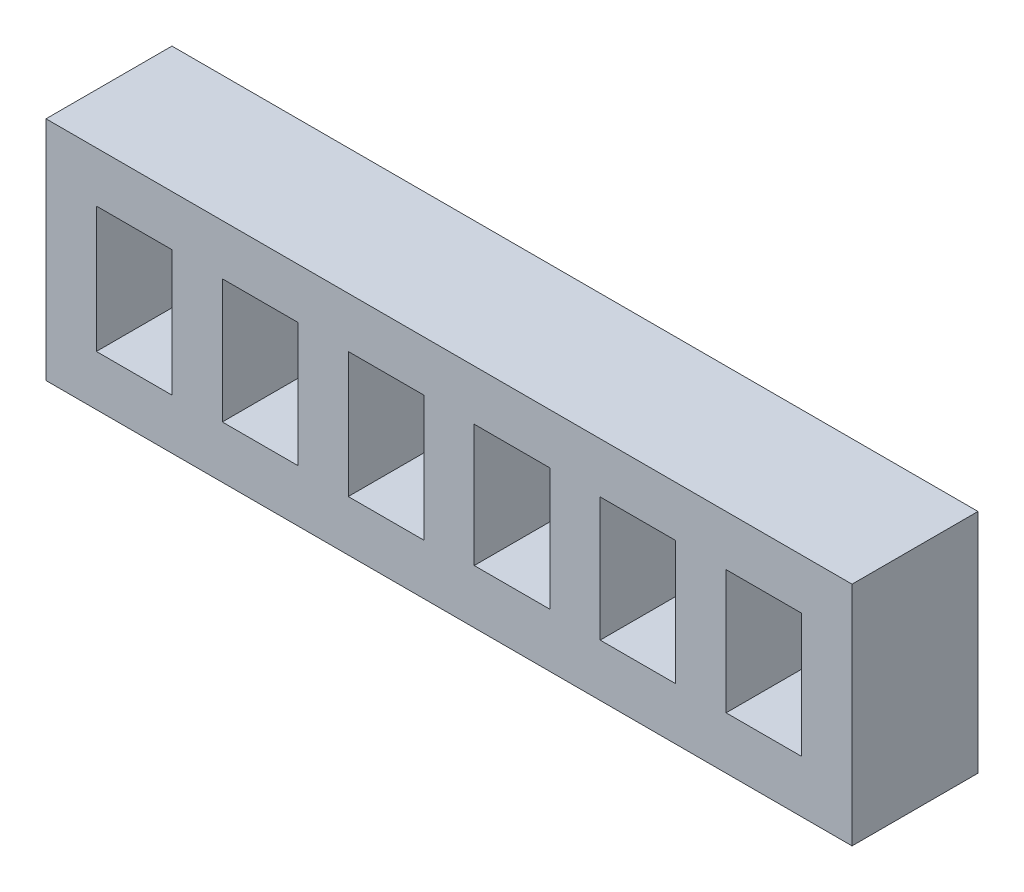
ISO-10303-21;
HEADER;
FILE_DESCRIPTION(('STEP AP214'),'2;1');
FILE_NAME('part.step','',(''),(''),'','','');
FILE_SCHEMA(('AUTOMOTIVE_DESIGN { 1 0 10303 214 1 1 1 1 }'));
ENDSEC;
DATA;
#1=APPLICATION_CONTEXT('core data for automotive mechanical design processes');
#2=APPLICATION_PROTOCOL_DEFINITION('international standard','automotive_design',2000,#1);
#3=PRODUCT_CONTEXT('',#1,'mechanical');
#4=PRODUCT('Part','Part','',(#3));
#5=PRODUCT_RELATED_PRODUCT_CATEGORY('part','',(#4));
#6=PRODUCT_DEFINITION_FORMATION('','',#4);
#7=PRODUCT_DEFINITION_CONTEXT('part definition',#1,'design');
#8=PRODUCT_DEFINITION('design','',#6,#7);
#9=PRODUCT_DEFINITION_SHAPE('','',#8);
#10=(LENGTH_UNIT() NAMED_UNIT(*) SI_UNIT(.MILLI.,.METRE.));
#11=(NAMED_UNIT(*) PLANE_ANGLE_UNIT() SI_UNIT($,.RADIAN.));
#12=(NAMED_UNIT(*) SI_UNIT($,.STERADIAN.) SOLID_ANGLE_UNIT());
#13=UNCERTAINTY_MEASURE_WITH_UNIT(LENGTH_MEASURE(1.E-05),#10,'distance_accuracy_value','');
#14=(GEOMETRIC_REPRESENTATION_CONTEXT(3) GLOBAL_UNCERTAINTY_ASSIGNED_CONTEXT((#13)) GLOBAL_UNIT_ASSIGNED_CONTEXT((#10,
#11,#12)) REPRESENTATION_CONTEXT('',''));
#15=CARTESIAN_POINT('',(0.,0.,0.));
#16=DIRECTION('',(0.,0.,1.));
#17=DIRECTION('',(1.,0.,0.));
#18=AXIS2_PLACEMENT_3D('',#15,#16,#17);
#19=CARTESIAN_POINT('',(0.,0.,5.));
#20=DIRECTION('',(0.,0.,1.));
#21=DIRECTION('',(1.,0.,0.));
#22=AXIS2_PLACEMENT_3D('',#19,#20,#21);
#23=PLANE('',#22);
#24=DIRECTION('',(0.,-1.,0.));
#25=VECTOR('',#24,1.);
#26=CARTESIAN_POINT('',(-33.4517617537196,11.6505157158308,5.));
#27=LINE('',#26,#25);
#28=CARTESIAN_POINT('',(-33.4517617537196,11.6505157158308,5.));
#29=VERTEX_POINT('',#28);
#30=CARTESIAN_POINT('',(-33.4517617537196,2.65051571583079,5.));
#31=VERTEX_POINT('',#30);
#32=EDGE_CURVE('E488',#29,#31,#27,.T.);
#33=ORIENTED_EDGE('',*,*,#32,.T.);
#34=DIRECTION('',(1.,0.,0.));
#35=VECTOR('',#34,1.);
#36=CARTESIAN_POINT('',(-33.4517617537196,2.65051571583079,5.));
#37=LINE('',#36,#35);
#38=CARTESIAN_POINT('',(-1.45176175371964,2.65051571583079,5.));
#39=VERTEX_POINT('',#38);
#40=EDGE_CURVE('E492',#31,#39,#37,.T.);
#41=ORIENTED_EDGE('',*,*,#40,.T.);
#42=DIRECTION('',(0.,1.,0.));
#43=VECTOR('',#42,1.);
#44=CARTESIAN_POINT('',(-1.45176175371964,11.6505157158308,5.));
#45=LINE('',#44,#43);
#46=CARTESIAN_POINT('',(-1.45176175371964,11.6505157158308,5.));
#47=VERTEX_POINT('',#46);
#48=EDGE_CURVE('E496',#39,#47,#45,.T.);
#49=ORIENTED_EDGE('',*,*,#48,.T.);
#50=DIRECTION('',(-1.,0.,0.));
#51=VECTOR('',#50,1.);
#52=CARTESIAN_POINT('',(-33.4517617537196,11.6505157158308,5.));
#53=LINE('',#52,#51);
#54=EDGE_CURVE('E499',#47,#29,#53,.T.);
#55=ORIENTED_EDGE('',*,*,#54,.T.);
#56=EDGE_LOOP('',(#33,#41,#49,#55));
#57=FACE_BOUND('',#56,.T.);
#58=DIRECTION('',(1.,0.,0.));
#59=VECTOR('',#58,1.);
#60=CARTESIAN_POINT('',(-31.4517617537196,4.65051571583079,5.));
#61=LINE('',#60,#59);
#62=CARTESIAN_POINT('',(-31.4517617537196,4.65051571583079,5.));
#63=VERTEX_POINT('',#62);
#64=CARTESIAN_POINT('',(-28.4517617537196,4.65051571583079,5.));
#65=VERTEX_POINT('',#64);
#66=EDGE_CURVE('E448',#63,#65,#61,.T.);
#67=ORIENTED_EDGE('',*,*,#66,.F.);
#68=DIRECTION('',(0.,-1.,0.));
#69=VECTOR('',#68,1.);
#70=CARTESIAN_POINT('',(-31.4517617537196,9.65051571583079,5.));
#71=LINE('',#70,#69);
#72=CARTESIAN_POINT('',(-31.4517617537196,9.65051571583079,5.));
#73=VERTEX_POINT('',#72);
#74=EDGE_CURVE('E445',#73,#63,#71,.T.);
#75=ORIENTED_EDGE('',*,*,#74,.F.);
#76=DIRECTION('',(-1.,0.,0.));
#77=VECTOR('',#76,1.);
#78=CARTESIAN_POINT('',(-31.4517617537196,9.65051571583079,5.));
#79=LINE('',#78,#77);
#80=CARTESIAN_POINT('',(-28.4517617537196,9.65051571583079,5.));
#81=VERTEX_POINT('',#80);
#82=EDGE_CURVE('E456',#81,#73,#79,.T.);
#83=ORIENTED_EDGE('',*,*,#82,.F.);
#84=DIRECTION('',(0.,1.,0.));
#85=VECTOR('',#84,1.);
#86=CARTESIAN_POINT('',(-28.4517617537196,9.65051571583079,5.));
#87=LINE('',#86,#85);
#88=EDGE_CURVE('E452',#65,#81,#87,.T.);
#89=ORIENTED_EDGE('',*,*,#88,.F.);
#90=EDGE_LOOP('',(#67,#75,#83,#89));
#91=FACE_BOUND('',#90,.T.);
#92=DIRECTION('',(1.,0.,0.));
#93=VECTOR('',#92,1.);
#94=CARTESIAN_POINT('',(-26.4517617537196,4.72676749636952,5.));
#95=LINE('',#94,#93);
#96=CARTESIAN_POINT('',(-26.4517617537196,4.72676749636952,5.));
#97=VERTEX_POINT('',#96);
#98=CARTESIAN_POINT('',(-23.4517617537196,4.72676749636952,5.));
#99=VERTEX_POINT('',#98);
#100=EDGE_CURVE('E405',#97,#99,#95,.T.);
#101=ORIENTED_EDGE('',*,*,#100,.F.);
#102=DIRECTION('',(0.,-1.,0.));
#103=VECTOR('',#102,1.);
#104=CARTESIAN_POINT('',(-26.4517617537196,9.65051571583079,5.));
#105=LINE('',#104,#103);
#106=CARTESIAN_POINT('',(-26.4517617537196,9.65051571583079,5.));
#107=VERTEX_POINT('',#106);
#108=EDGE_CURVE('E402',#107,#97,#105,.T.);
#109=ORIENTED_EDGE('',*,*,#108,.F.);
#110=DIRECTION('',(-1.,0.,0.));
#111=VECTOR('',#110,1.);
#112=CARTESIAN_POINT('',(-26.4517617537196,9.65051571583079,5.));
#113=LINE('',#112,#111);
#114=CARTESIAN_POINT('',(-23.4517617537196,9.65051571583079,5.));
#115=VERTEX_POINT('',#114);
#116=EDGE_CURVE('E413',#115,#107,#113,.T.);
#117=ORIENTED_EDGE('',*,*,#116,.F.);
#118=DIRECTION('',(0.,1.,0.));
#119=VECTOR('',#118,1.);
#120=CARTESIAN_POINT('',(-23.4517617537196,9.65051571583079,5.));
#121=LINE('',#120,#119);
#122=EDGE_CURVE('E409',#99,#115,#121,.T.);
#123=ORIENTED_EDGE('',*,*,#122,.F.);
#124=EDGE_LOOP('',(#101,#109,#117,#123));
#125=FACE_BOUND('',#124,.T.);
#126=DIRECTION('',(1.,0.,0.));
#127=VECTOR('',#126,1.);
#128=CARTESIAN_POINT('',(-21.4517617537196,4.66298464848896,5.));
#129=LINE('',#128,#127);
#130=CARTESIAN_POINT('',(-21.4517617537196,4.66298464848896,5.));
#131=VERTEX_POINT('',#130);
#132=CARTESIAN_POINT('',(-18.4517617537196,4.66298464848896,5.));
#133=VERTEX_POINT('',#132);
#134=EDGE_CURVE('E362',#131,#133,#129,.T.);
#135=ORIENTED_EDGE('',*,*,#134,.F.);
#136=DIRECTION('',(0.,-1.,0.));
#137=VECTOR('',#136,1.);
#138=CARTESIAN_POINT('',(-21.4517617537196,9.65051571583079,5.));
#139=LINE('',#138,#137);
#140=CARTESIAN_POINT('',(-21.4517617537196,9.65051571583079,5.));
#141=VERTEX_POINT('',#140);
#142=EDGE_CURVE('E359',#141,#131,#139,.T.);
#143=ORIENTED_EDGE('',*,*,#142,.F.);
#144=DIRECTION('',(-1.,0.,0.));
#145=VECTOR('',#144,1.);
#146=CARTESIAN_POINT('',(-21.4517617537196,9.65051571583079,5.));
#147=LINE('',#146,#145);
#148=CARTESIAN_POINT('',(-18.4517617537196,9.65051571583079,5.));
#149=VERTEX_POINT('',#148);
#150=EDGE_CURVE('E370',#149,#141,#147,.T.);
#151=ORIENTED_EDGE('',*,*,#150,.F.);
#152=DIRECTION('',(0.,1.,0.));
#153=VECTOR('',#152,1.);
#154=CARTESIAN_POINT('',(-18.4517617537196,9.65051571583079,5.));
#155=LINE('',#154,#153);
#156=EDGE_CURVE('E366',#133,#149,#155,.T.);
#157=ORIENTED_EDGE('',*,*,#156,.F.);
#158=EDGE_LOOP('',(#135,#143,#151,#157));
#159=FACE_BOUND('',#158,.T.);
#160=DIRECTION('',(1.,0.,0.));
#161=VECTOR('',#160,1.);
#162=CARTESIAN_POINT('',(-16.4517617537196,4.79055034424978,5.));
#163=LINE('',#162,#161);
#164=CARTESIAN_POINT('',(-16.4517617537196,4.79055034424978,5.));
#165=VERTEX_POINT('',#164);
#166=CARTESIAN_POINT('',(-13.4517617537196,4.79055034424978,5.));
#167=VERTEX_POINT('',#166);
#168=EDGE_CURVE('E319',#165,#167,#163,.T.);
#169=ORIENTED_EDGE('',*,*,#168,.F.);
#170=DIRECTION('',(0.,-1.,0.));
#171=VECTOR('',#170,1.);
#172=CARTESIAN_POINT('',(-16.4517617537196,9.65051571583079,5.));
#173=LINE('',#172,#171);
#174=CARTESIAN_POINT('',(-16.4517617537196,9.65051571583079,5.));
#175=VERTEX_POINT('',#174);
#176=EDGE_CURVE('E316',#175,#165,#173,.T.);
#177=ORIENTED_EDGE('',*,*,#176,.F.);
#178=DIRECTION('',(-1.,0.,0.));
#179=VECTOR('',#178,1.);
#180=CARTESIAN_POINT('',(-16.4517617537196,9.65051571583079,5.));
#181=LINE('',#180,#179);
#182=CARTESIAN_POINT('',(-13.4517617537196,9.65051571583079,5.));
#183=VERTEX_POINT('',#182);
#184=EDGE_CURVE('E327',#183,#175,#181,.T.);
#185=ORIENTED_EDGE('',*,*,#184,.F.);
#186=DIRECTION('',(0.,1.,0.));
#187=VECTOR('',#186,1.);
#188=CARTESIAN_POINT('',(-13.4517617537196,9.65051571583079,5.));
#189=LINE('',#188,#187);
#190=EDGE_CURVE('E323',#167,#183,#189,.T.);
#191=ORIENTED_EDGE('',*,*,#190,.F.);
#192=EDGE_LOOP('',(#169,#177,#185,#191));
#193=FACE_BOUND('',#192,.T.);
#194=DIRECTION('',(1.,0.,0.));
#195=VECTOR('',#194,1.);
#196=CARTESIAN_POINT('',(-11.4517617537196,4.72676749636921,5.));
#197=LINE('',#196,#195);
#198=CARTESIAN_POINT('',(-11.4517617537196,4.72676749636921,5.));
#199=VERTEX_POINT('',#198);
#200=CARTESIAN_POINT('',(-8.45176175371964,4.72676749636921,5.));
#201=VERTEX_POINT('',#200);
#202=EDGE_CURVE('E276',#199,#201,#197,.T.);
#203=ORIENTED_EDGE('',*,*,#202,.F.);
#204=DIRECTION('',(0.,-1.,0.));
#205=VECTOR('',#204,1.);
#206=CARTESIAN_POINT('',(-11.4517617537196,9.65051571583079,5.));
#207=LINE('',#206,#205);
#208=CARTESIAN_POINT('',(-11.4517617537196,9.65051571583079,5.));
#209=VERTEX_POINT('',#208);
#210=EDGE_CURVE('E273',#209,#199,#207,.T.);
#211=ORIENTED_EDGE('',*,*,#210,.F.);
#212=DIRECTION('',(-1.,0.,0.));
#213=VECTOR('',#212,1.);
#214=CARTESIAN_POINT('',(-11.4517617537196,9.65051571583079,5.));
#215=LINE('',#214,#213);
#216=CARTESIAN_POINT('',(-8.45176175371964,9.65051571583079,5.));
#217=VERTEX_POINT('',#216);
#218=EDGE_CURVE('E284',#217,#209,#215,.T.);
#219=ORIENTED_EDGE('',*,*,#218,.F.);
#220=DIRECTION('',(0.,1.,0.));
#221=VECTOR('',#220,1.);
#222=CARTESIAN_POINT('',(-8.45176175371964,9.65051571583079,5.));
#223=LINE('',#222,#221);
#224=EDGE_CURVE('E280',#201,#217,#223,.T.);
#225=ORIENTED_EDGE('',*,*,#224,.F.);
#226=EDGE_LOOP('',(#203,#211,#219,#225));
#227=FACE_BOUND('',#226,.T.);
#228=DIRECTION('',(1.,0.,0.));
#229=VECTOR('',#228,1.);
#230=CARTESIAN_POINT('',(-6.45176175371964,4.72676749636921,5.));
#231=LINE('',#230,#229);
#232=CARTESIAN_POINT('',(-6.45176175371964,4.72676749636921,5.));
#233=VERTEX_POINT('',#232);
#234=CARTESIAN_POINT('',(-3.45176175371964,4.72676749636921,5.));
#235=VERTEX_POINT('',#234);
#236=EDGE_CURVE('E234',#233,#235,#231,.T.);
#237=ORIENTED_EDGE('',*,*,#236,.F.);
#238=DIRECTION('',(0.,-1.,0.));
#239=VECTOR('',#238,1.);
#240=CARTESIAN_POINT('',(-6.45176175371964,9.65051571583079,5.));
#241=LINE('',#240,#239);
#242=CARTESIAN_POINT('',(-6.45176175371964,9.65051571583079,5.));
#243=VERTEX_POINT('',#242);
#244=EDGE_CURVE('E225',#243,#233,#241,.T.);
#245=ORIENTED_EDGE('',*,*,#244,.F.);
#246=DIRECTION('',(-1.,0.,0.));
#247=VECTOR('',#246,1.);
#248=CARTESIAN_POINT('',(-6.45176175371964,9.65051571583079,5.));
#249=LINE('',#248,#247);
#250=CARTESIAN_POINT('',(-3.45176175371964,9.65051571583079,5.));
#251=VERTEX_POINT('',#250);
#252=EDGE_CURVE('E251',#251,#243,#249,.T.);
#253=ORIENTED_EDGE('',*,*,#252,.F.);
#254=DIRECTION('',(0.,1.,0.));
#255=VECTOR('',#254,1.);
#256=CARTESIAN_POINT('',(-3.45176175371964,9.65051571583079,5.));
#257=LINE('',#256,#255);
#258=EDGE_CURVE('E247',#235,#251,#257,.T.);
#259=ORIENTED_EDGE('',*,*,#258,.F.);
#260=EDGE_LOOP('',(#237,#245,#253,#259));
#261=FACE_BOUND('',#260,.T.);
#262=ADVANCED_FACE('F39',(#57,#91,#125,#159,#193,#227,#261),#23,.T.);
#263=CARTESIAN_POINT('',(0.,0.,0.));
#264=DIRECTION('',(0.,0.,1.));
#265=DIRECTION('',(1.,0.,0.));
#266=AXIS2_PLACEMENT_3D('',#263,#264,#265);
#267=PLANE('',#266);
#268=DIRECTION('',(0.,-1.,0.));
#269=VECTOR('',#268,1.);
#270=CARTESIAN_POINT('',(-11.4517617537196,9.65051571583079,0.));
#271=LINE('',#270,#269);
#272=CARTESIAN_POINT('',(-11.4517617537196,9.65051571583079,0.));
#273=VERTEX_POINT('',#272);
#274=CARTESIAN_POINT('',(-11.4517617537196,4.72676749636921,0.));
#275=VERTEX_POINT('',#274);
#276=EDGE_CURVE('E243',#273,#275,#271,.T.);
#277=ORIENTED_EDGE('',*,*,#276,.T.);
#278=DIRECTION('',(1.,0.,0.));
#279=VECTOR('',#278,1.);
#280=CARTESIAN_POINT('',(-11.4517617537196,4.72676749636921,0.));
#281=LINE('',#280,#279);
#282=CARTESIAN_POINT('',(-8.45176175371964,4.72676749636921,0.));
#283=VERTEX_POINT('',#282);
#284=EDGE_CURVE('E291',#275,#283,#281,.T.);
#285=ORIENTED_EDGE('',*,*,#284,.T.);
#286=DIRECTION('',(0.,1.,0.));
#287=VECTOR('',#286,1.);
#288=CARTESIAN_POINT('',(-8.45176175371964,9.65051571583079,0.));
#289=LINE('',#288,#287);
#290=CARTESIAN_POINT('',(-8.45176175371964,9.65051571583079,0.));
#291=VERTEX_POINT('',#290);
#292=EDGE_CURVE('E295',#283,#291,#289,.T.);
#293=ORIENTED_EDGE('',*,*,#292,.T.);
#294=DIRECTION('',(-1.,0.,0.));
#295=VECTOR('',#294,1.);
#296=CARTESIAN_POINT('',(-11.4517617537196,9.65051571583079,0.));
#297=LINE('',#296,#295);
#298=EDGE_CURVE('E277',#291,#273,#297,.T.);
#299=ORIENTED_EDGE('',*,*,#298,.T.);
#300=EDGE_LOOP('',(#277,#285,#293,#299));
#301=FACE_BOUND('',#300,.T.);
#302=DIRECTION('',(0.,-1.,0.));
#303=VECTOR('',#302,1.);
#304=CARTESIAN_POINT('',(-21.4517617537196,9.65051571583079,0.));
#305=LINE('',#304,#303);
#306=CARTESIAN_POINT('',(-21.4517617537196,9.65051571583079,0.));
#307=VERTEX_POINT('',#306);
#308=CARTESIAN_POINT('',(-21.4517617537196,4.66298464848896,0.));
#309=VERTEX_POINT('',#308);
#310=EDGE_CURVE('E358',#307,#309,#305,.T.);
#311=ORIENTED_EDGE('',*,*,#310,.T.);
#312=DIRECTION('',(1.,0.,0.));
#313=VECTOR('',#312,1.);
#314=CARTESIAN_POINT('',(-21.4517617537196,4.66298464848896,0.));
#315=LINE('',#314,#313);
#316=CARTESIAN_POINT('',(-18.4517617537196,4.66298464848896,0.));
#317=VERTEX_POINT('',#316);
#318=EDGE_CURVE('E377',#309,#317,#315,.T.);
#319=ORIENTED_EDGE('',*,*,#318,.T.);
#320=DIRECTION('',(0.,1.,0.));
#321=VECTOR('',#320,1.);
#322=CARTESIAN_POINT('',(-18.4517617537196,9.65051571583079,0.));
#323=LINE('',#322,#321);
#324=CARTESIAN_POINT('',(-18.4517617537196,9.65051571583079,0.));
#325=VERTEX_POINT('',#324);
#326=EDGE_CURVE('E381',#317,#325,#323,.T.);
#327=ORIENTED_EDGE('',*,*,#326,.T.);
#328=DIRECTION('',(-1.,0.,0.));
#329=VECTOR('',#328,1.);
#330=CARTESIAN_POINT('',(-21.4517617537196,9.65051571583079,0.));
#331=LINE('',#330,#329);
#332=EDGE_CURVE('E363',#325,#307,#331,.T.);
#333=ORIENTED_EDGE('',*,*,#332,.T.);
#334=EDGE_LOOP('',(#311,#319,#327,#333));
#335=FACE_BOUND('',#334,.T.);
#336=DIRECTION('',(0.,-1.,0.));
#337=VECTOR('',#336,1.);
#338=CARTESIAN_POINT('',(-31.4517617537196,9.65051571583079,0.));
#339=LINE('',#338,#337);
#340=CARTESIAN_POINT('',(-31.4517617537196,9.65051571583079,0.));
#341=VERTEX_POINT('',#340);
#342=CARTESIAN_POINT('',(-31.4517617537196,4.65051571583079,0.));
#343=VERTEX_POINT('',#342);
#344=EDGE_CURVE('E444',#341,#343,#339,.T.);
#345=ORIENTED_EDGE('',*,*,#344,.T.);
#346=DIRECTION('',(1.,0.,0.));
#347=VECTOR('',#346,1.);
#348=CARTESIAN_POINT('',(-31.4517617537196,4.65051571583079,0.));
#349=LINE('',#348,#347);
#350=CARTESIAN_POINT('',(-28.4517617537196,4.65051571583079,0.));
#351=VERTEX_POINT('',#350);
#352=EDGE_CURVE('E463',#343,#351,#349,.T.);
#353=ORIENTED_EDGE('',*,*,#352,.T.);
#354=DIRECTION('',(0.,1.,0.));
#355=VECTOR('',#354,1.);
#356=CARTESIAN_POINT('',(-28.4517617537196,9.65051571583079,0.));
#357=LINE('',#356,#355);
#358=CARTESIAN_POINT('',(-28.4517617537196,9.65051571583079,0.));
#359=VERTEX_POINT('',#358);
#360=EDGE_CURVE('E467',#351,#359,#357,.T.);
#361=ORIENTED_EDGE('',*,*,#360,.T.);
#362=DIRECTION('',(-1.,0.,0.));
#363=VECTOR('',#362,1.);
#364=CARTESIAN_POINT('',(-31.4517617537196,9.65051571583079,0.));
#365=LINE('',#364,#363);
#366=EDGE_CURVE('E449',#359,#341,#365,.T.);
#367=ORIENTED_EDGE('',*,*,#366,.T.);
#368=EDGE_LOOP('',(#345,#353,#361,#367));
#369=FACE_BOUND('',#368,.T.);
#370=DIRECTION('',(0.,-1.,0.));
#371=VECTOR('',#370,1.);
#372=CARTESIAN_POINT('',(-33.4517617537196,11.6505157158308,0.));
#373=LINE('',#372,#371);
#374=CARTESIAN_POINT('',(-33.4517617537196,11.6505157158308,0.));
#375=VERTEX_POINT('',#374);
#376=CARTESIAN_POINT('',(-33.4517617537196,2.65051571583079,0.));
#377=VERTEX_POINT('',#376);
#378=EDGE_CURVE('E487',#375,#377,#373,.T.);
#379=ORIENTED_EDGE('',*,*,#378,.F.);
#380=DIRECTION('',(-1.,0.,0.));
#381=VECTOR('',#380,1.);
#382=CARTESIAN_POINT('',(-33.4517617537196,11.6505157158308,0.));
#383=LINE('',#382,#381);
#384=CARTESIAN_POINT('',(-1.45176175371964,11.6505157158308,0.));
#385=VERTEX_POINT('',#384);
#386=EDGE_CURVE('E493',#385,#375,#383,.T.);
#387=ORIENTED_EDGE('',*,*,#386,.F.);
#388=DIRECTION('',(0.,1.,0.));
#389=VECTOR('',#388,1.);
#390=CARTESIAN_POINT('',(-1.45176175371964,11.6505157158308,0.));
#391=LINE('',#390,#389);
#392=CARTESIAN_POINT('',(-1.45176175371964,2.65051571583079,0.));
#393=VERTEX_POINT('',#392);
#394=EDGE_CURVE('E509',#393,#385,#391,.T.);
#395=ORIENTED_EDGE('',*,*,#394,.F.);
#396=DIRECTION('',(1.,0.,0.));
#397=VECTOR('',#396,1.);
#398=CARTESIAN_POINT('',(-33.4517617537196,2.65051571583079,0.));
#399=LINE('',#398,#397);
#400=EDGE_CURVE('E506',#377,#393,#399,.T.);
#401=ORIENTED_EDGE('',*,*,#400,.F.);
#402=EDGE_LOOP('',(#379,#387,#395,#401));
#403=FACE_BOUND('',#402,.T.);
#404=DIRECTION('',(0.,-1.,0.));
#405=VECTOR('',#404,1.);
#406=CARTESIAN_POINT('',(-26.4517617537196,9.65051571583079,0.));
#407=LINE('',#406,#405);
#408=CARTESIAN_POINT('',(-26.4517617537196,9.65051571583079,0.));
#409=VERTEX_POINT('',#408);
#410=CARTESIAN_POINT('',(-26.4517617537196,4.72676749636952,0.));
#411=VERTEX_POINT('',#410);
#412=EDGE_CURVE('E401',#409,#411,#407,.T.);
#413=ORIENTED_EDGE('',*,*,#412,.T.);
#414=DIRECTION('',(1.,0.,0.));
#415=VECTOR('',#414,1.);
#416=CARTESIAN_POINT('',(-26.4517617537196,4.72676749636952,0.));
#417=LINE('',#416,#415);
#418=CARTESIAN_POINT('',(-23.4517617537196,4.72676749636952,0.));
#419=VERTEX_POINT('',#418);
#420=EDGE_CURVE('E420',#411,#419,#417,.T.);
#421=ORIENTED_EDGE('',*,*,#420,.T.);
#422=DIRECTION('',(0.,1.,0.));
#423=VECTOR('',#422,1.);
#424=CARTESIAN_POINT('',(-23.4517617537196,9.65051571583079,0.));
#425=LINE('',#424,#423);
#426=CARTESIAN_POINT('',(-23.4517617537196,9.65051571583079,0.));
#427=VERTEX_POINT('',#426);
#428=EDGE_CURVE('E424',#419,#427,#425,.T.);
#429=ORIENTED_EDGE('',*,*,#428,.T.);
#430=DIRECTION('',(-1.,0.,0.));
#431=VECTOR('',#430,1.);
#432=CARTESIAN_POINT('',(-26.4517617537196,9.65051571583079,0.));
#433=LINE('',#432,#431);
#434=EDGE_CURVE('E406',#427,#409,#433,.T.);
#435=ORIENTED_EDGE('',*,*,#434,.T.);
#436=EDGE_LOOP('',(#413,#421,#429,#435));
#437=FACE_BOUND('',#436,.T.);
#438=DIRECTION('',(0.,-1.,0.));
#439=VECTOR('',#438,1.);
#440=CARTESIAN_POINT('',(-16.4517617537196,9.65051571583079,0.));
#441=LINE('',#440,#439);
#442=CARTESIAN_POINT('',(-16.4517617537196,9.65051571583079,0.));
#443=VERTEX_POINT('',#442);
#444=CARTESIAN_POINT('',(-16.4517617537196,4.79055034424978,0.));
#445=VERTEX_POINT('',#444);
#446=EDGE_CURVE('E315',#443,#445,#441,.T.);
#447=ORIENTED_EDGE('',*,*,#446,.T.);
#448=DIRECTION('',(1.,0.,0.));
#449=VECTOR('',#448,1.);
#450=CARTESIAN_POINT('',(-16.4517617537196,4.79055034424978,0.));
#451=LINE('',#450,#449);
#452=CARTESIAN_POINT('',(-13.4517617537196,4.79055034424978,0.));
#453=VERTEX_POINT('',#452);
#454=EDGE_CURVE('E334',#445,#453,#451,.T.);
#455=ORIENTED_EDGE('',*,*,#454,.T.);
#456=DIRECTION('',(0.,1.,0.));
#457=VECTOR('',#456,1.);
#458=CARTESIAN_POINT('',(-13.4517617537196,9.65051571583079,0.));
#459=LINE('',#458,#457);
#460=CARTESIAN_POINT('',(-13.4517617537196,9.65051571583079,0.));
#461=VERTEX_POINT('',#460);
#462=EDGE_CURVE('E338',#453,#461,#459,.T.);
#463=ORIENTED_EDGE('',*,*,#462,.T.);
#464=DIRECTION('',(-1.,0.,0.));
#465=VECTOR('',#464,1.);
#466=CARTESIAN_POINT('',(-16.4517617537196,9.65051571583079,0.));
#467=LINE('',#466,#465);
#468=EDGE_CURVE('E320',#461,#443,#467,.T.);
#469=ORIENTED_EDGE('',*,*,#468,.T.);
#470=EDGE_LOOP('',(#447,#455,#463,#469));
#471=FACE_BOUND('',#470,.T.);
#472=DIRECTION('',(0.,-1.,0.));
#473=VECTOR('',#472,1.);
#474=CARTESIAN_POINT('',(-6.45176175371964,9.65051571583079,0.));
#475=LINE('',#474,#473);
#476=CARTESIAN_POINT('',(-6.45176175371964,9.65051571583079,0.));
#477=VERTEX_POINT('',#476);
#478=CARTESIAN_POINT('',(-6.45176175371964,4.72676749636921,0.));
#479=VERTEX_POINT('',#478);
#480=EDGE_CURVE('E63',#477,#479,#475,.T.);
#481=ORIENTED_EDGE('',*,*,#480,.T.);
#482=DIRECTION('',(1.,0.,0.));
#483=VECTOR('',#482,1.);
#484=CARTESIAN_POINT('',(-6.45176175371964,4.72676749636921,0.));
#485=LINE('',#484,#483);
#486=CARTESIAN_POINT('',(-3.45176175371964,4.72676749636921,0.));
#487=VERTEX_POINT('',#486);
#488=EDGE_CURVE('E241',#479,#487,#485,.T.);
#489=ORIENTED_EDGE('',*,*,#488,.T.);
#490=DIRECTION('',(0.,1.,0.));
#491=VECTOR('',#490,1.);
#492=CARTESIAN_POINT('',(-3.45176175371964,9.65051571583079,0.));
#493=LINE('',#492,#491);
#494=CARTESIAN_POINT('',(-3.45176175371964,9.65051571583079,0.));
#495=VERTEX_POINT('',#494);
#496=EDGE_CURVE('E260',#487,#495,#493,.T.);
#497=ORIENTED_EDGE('',*,*,#496,.T.);
#498=DIRECTION('',(-1.,0.,0.));
#499=VECTOR('',#498,1.);
#500=CARTESIAN_POINT('',(-6.45176175371964,9.65051571583079,0.));
#501=LINE('',#500,#499);
#502=EDGE_CURVE('E235',#495,#477,#501,.T.);
#503=ORIENTED_EDGE('',*,*,#502,.T.);
#504=EDGE_LOOP('',(#481,#489,#497,#503));
#505=FACE_BOUND('',#504,.T.);
#506=ADVANCED_FACE('F532',(#301,#335,#369,#403,#437,#471,#505),#267,.F.);
#507=CARTESIAN_POINT('',(-33.4517617537196,11.6505157158308,5.));
#508=DIRECTION('',(1.,0.,0.));
#509=DIRECTION('',(0.,0.,-1.));
#510=AXIS2_PLACEMENT_3D('',#507,#508,#509);
#511=PLANE('',#510);
#512=ORIENTED_EDGE('',*,*,#378,.T.);
#513=DIRECTION('',(0.,0.,-1.));
#514=VECTOR('',#513,1.);
#515=CARTESIAN_POINT('',(-33.4517617537196,2.65051571583079,5.));
#516=LINE('',#515,#514);
#517=EDGE_CURVE('E11',#31,#377,#516,.T.);
#518=ORIENTED_EDGE('',*,*,#517,.F.);
#519=ORIENTED_EDGE('',*,*,#32,.F.);
#520=DIRECTION('',(0.,0.,-1.));
#521=VECTOR('',#520,1.);
#522=CARTESIAN_POINT('',(-33.4517617537196,11.6505157158308,5.));
#523=LINE('',#522,#521);
#524=EDGE_CURVE('E502',#29,#375,#523,.T.);
#525=ORIENTED_EDGE('',*,*,#524,.T.);
#526=EDGE_LOOP('',(#512,#518,#519,#525));
#527=FACE_BOUND('',#526,.T.);
#528=ADVANCED_FACE('F41',(#527),#511,.F.);
#529=CARTESIAN_POINT('',(-33.4517617537196,2.65051571583079,5.));
#530=DIRECTION('',(0.,1.,0.));
#531=DIRECTION('',(0.,0.,1.));
#532=AXIS2_PLACEMENT_3D('',#529,#530,#531);
#533=PLANE('',#532);
#534=ORIENTED_EDGE('',*,*,#400,.T.);
#535=DIRECTION('',(0.,0.,-1.));
#536=VECTOR('',#535,1.);
#537=CARTESIAN_POINT('',(-1.45176175371964,2.65051571583079,5.));
#538=LINE('',#537,#536);
#539=EDGE_CURVE('E48',#39,#393,#538,.T.);
#540=ORIENTED_EDGE('',*,*,#539,.F.);
#541=ORIENTED_EDGE('',*,*,#40,.F.);
#542=ORIENTED_EDGE('',*,*,#517,.T.);
#543=EDGE_LOOP('',(#534,#540,#541,#542));
#544=FACE_BOUND('',#543,.T.);
#545=ADVANCED_FACE('F543',(#544),#533,.F.);
#546=CARTESIAN_POINT('',(-1.45176175371964,11.6505157158308,5.));
#547=DIRECTION('',(-1.,0.,0.));
#548=DIRECTION('',(0.,-1.,0.));
#549=AXIS2_PLACEMENT_3D('',#546,#547,#548);
#550=PLANE('',#549);
#551=ORIENTED_EDGE('',*,*,#394,.T.);
#552=DIRECTION('',(0.,0.,-1.));
#553=VECTOR('',#552,1.);
#554=CARTESIAN_POINT('',(-1.45176175371964,11.6505157158308,5.));
#555=LINE('',#554,#553);
#556=EDGE_CURVE('E517',#47,#385,#555,.T.);
#557=ORIENTED_EDGE('',*,*,#556,.F.);
#558=ORIENTED_EDGE('',*,*,#48,.F.);
#559=ORIENTED_EDGE('',*,*,#539,.T.);
#560=EDGE_LOOP('',(#551,#557,#558,#559));
#561=FACE_BOUND('',#560,.T.);
#562=ADVANCED_FACE('F526',(#561),#550,.F.);
#563=CARTESIAN_POINT('',(-33.4517617537196,11.6505157158308,5.));
#564=DIRECTION('',(0.,-1.,0.));
#565=DIRECTION('',(0.,0.,-1.));
#566=AXIS2_PLACEMENT_3D('',#563,#564,#565);
#567=PLANE('',#566);
#568=ORIENTED_EDGE('',*,*,#386,.T.);
#569=ORIENTED_EDGE('',*,*,#524,.F.);
#570=ORIENTED_EDGE('',*,*,#54,.F.);
#571=ORIENTED_EDGE('',*,*,#556,.T.);
#572=EDGE_LOOP('',(#568,#569,#570,#571));
#573=FACE_BOUND('',#572,.T.);
#574=ADVANCED_FACE('F536',(#573),#567,.F.);
#575=CARTESIAN_POINT('',(-31.4517617537196,9.65051571583079,5.));
#576=DIRECTION('',(1.,0.,0.));
#577=DIRECTION('',(0.,0.,-1.));
#578=AXIS2_PLACEMENT_3D('',#575,#576,#577);
#579=PLANE('',#578);
#580=ORIENTED_EDGE('',*,*,#344,.F.);
#581=DIRECTION('',(0.,0.,-1.));
#582=VECTOR('',#581,1.);
#583=CARTESIAN_POINT('',(-31.4517617537196,9.65051571583079,5.));
#584=LINE('',#583,#582);
#585=EDGE_CURVE('E459',#73,#341,#584,.T.);
#586=ORIENTED_EDGE('',*,*,#585,.F.);
#587=ORIENTED_EDGE('',*,*,#74,.T.);
#588=DIRECTION('',(0.,0.,-1.));
#589=VECTOR('',#588,1.);
#590=CARTESIAN_POINT('',(-31.4517617537196,4.65051571583079,5.));
#591=LINE('',#590,#589);
#592=EDGE_CURVE('E483',#63,#343,#591,.T.);
#593=ORIENTED_EDGE('',*,*,#592,.T.);
#594=EDGE_LOOP('',(#580,#586,#587,#593));
#595=FACE_BOUND('',#594,.T.);
#596=ADVANCED_FACE('F558',(#595),#579,.T.);
#597=CARTESIAN_POINT('',(-31.4517617537196,4.65051571583079,5.));
#598=DIRECTION('',(0.,1.,0.));
#599=DIRECTION('',(0.,0.,1.));
#600=AXIS2_PLACEMENT_3D('',#597,#598,#599);
#601=PLANE('',#600);
#602=ORIENTED_EDGE('',*,*,#352,.F.);
#603=ORIENTED_EDGE('',*,*,#592,.F.);
#604=ORIENTED_EDGE('',*,*,#66,.T.);
#605=DIRECTION('',(0.,0.,-1.));
#606=VECTOR('',#605,1.);
#607=CARTESIAN_POINT('',(-28.4517617537196,4.65051571583079,5.));
#608=LINE('',#607,#606);
#609=EDGE_CURVE('E480',#65,#351,#608,.T.);
#610=ORIENTED_EDGE('',*,*,#609,.T.);
#611=EDGE_LOOP('',(#602,#603,#604,#610));
#612=FACE_BOUND('',#611,.T.);
#613=ADVANCED_FACE('F565',(#612),#601,.T.);
#614=CARTESIAN_POINT('',(-28.4517617537196,9.65051571583079,5.));
#615=DIRECTION('',(-1.,0.,0.));
#616=DIRECTION('',(0.,0.,1.));
#617=AXIS2_PLACEMENT_3D('',#614,#615,#616);
#618=PLANE('',#617);
#619=ORIENTED_EDGE('',*,*,#360,.F.);
#620=ORIENTED_EDGE('',*,*,#609,.F.);
#621=ORIENTED_EDGE('',*,*,#88,.T.);
#622=DIRECTION('',(0.,0.,-1.));
#623=VECTOR('',#622,1.);
#624=CARTESIAN_POINT('',(-28.4517617537196,9.65051571583079,5.));
#625=LINE('',#624,#623);
#626=EDGE_CURVE('E477',#81,#359,#625,.T.);
#627=ORIENTED_EDGE('',*,*,#626,.T.);
#628=EDGE_LOOP('',(#619,#620,#621,#627));
#629=FACE_BOUND('',#628,.T.);
#630=ADVANCED_FACE('F570',(#629),#618,.T.);
#631=CARTESIAN_POINT('',(-31.4517617537196,9.65051571583079,5.));
#632=DIRECTION('',(0.,-1.,0.));
#633=DIRECTION('',(0.,0.,-1.));
#634=AXIS2_PLACEMENT_3D('',#631,#632,#633);
#635=PLANE('',#634);
#636=ORIENTED_EDGE('',*,*,#366,.F.);
#637=ORIENTED_EDGE('',*,*,#626,.F.);
#638=ORIENTED_EDGE('',*,*,#82,.T.);
#639=ORIENTED_EDGE('',*,*,#585,.T.);
#640=EDGE_LOOP('',(#636,#637,#638,#639));
#641=FACE_BOUND('',#640,.T.);
#642=ADVANCED_FACE('F578',(#641),#635,.T.);
#643=CARTESIAN_POINT('',(-26.4517617537196,9.65051571583079,5.));
#644=DIRECTION('',(1.,0.,0.));
#645=DIRECTION('',(0.,0.,-1.));
#646=AXIS2_PLACEMENT_3D('',#643,#644,#645);
#647=PLANE('',#646);
#648=ORIENTED_EDGE('',*,*,#412,.F.);
#649=DIRECTION('',(0.,0.,-1.));
#650=VECTOR('',#649,1.);
#651=CARTESIAN_POINT('',(-26.4517617537196,9.65051571583079,5.));
#652=LINE('',#651,#650);
#653=EDGE_CURVE('E416',#107,#409,#652,.T.);
#654=ORIENTED_EDGE('',*,*,#653,.F.);
#655=ORIENTED_EDGE('',*,*,#108,.T.);
#656=DIRECTION('',(0.,0.,-1.));
#657=VECTOR('',#656,1.);
#658=CARTESIAN_POINT('',(-26.4517617537196,4.72676749636952,5.));
#659=LINE('',#658,#657);
#660=EDGE_CURVE('E440',#97,#411,#659,.T.);
#661=ORIENTED_EDGE('',*,*,#660,.T.);
#662=EDGE_LOOP('',(#648,#654,#655,#661));
#663=FACE_BOUND('',#662,.T.);
#664=ADVANCED_FACE('F673',(#663),#647,.T.);
#665=CARTESIAN_POINT('',(-26.4517617537196,4.72676749636952,5.));
#666=DIRECTION('',(0.,1.,0.));
#667=DIRECTION('',(0.,0.,1.));
#668=AXIS2_PLACEMENT_3D('',#665,#666,#667);
#669=PLANE('',#668);
#670=ORIENTED_EDGE('',*,*,#420,.F.);
#671=ORIENTED_EDGE('',*,*,#660,.F.);
#672=ORIENTED_EDGE('',*,*,#100,.T.);
#673=DIRECTION('',(0.,0.,-1.));
#674=VECTOR('',#673,1.);
#675=CARTESIAN_POINT('',(-23.4517617537196,4.72676749636952,5.));
#676=LINE('',#675,#674);
#677=EDGE_CURVE('E437',#99,#419,#676,.T.);
#678=ORIENTED_EDGE('',*,*,#677,.T.);
#679=EDGE_LOOP('',(#670,#671,#672,#678));
#680=FACE_BOUND('',#679,.T.);
#681=ADVANCED_FACE('F669',(#680),#669,.T.);
#682=CARTESIAN_POINT('',(-23.4517617537196,9.65051571583079,5.));
#683=DIRECTION('',(-1.,0.,0.));
#684=DIRECTION('',(0.,-1.,0.));
#685=AXIS2_PLACEMENT_3D('',#682,#683,#684);
#686=PLANE('',#685);
#687=ORIENTED_EDGE('',*,*,#428,.F.);
#688=ORIENTED_EDGE('',*,*,#677,.F.);
#689=ORIENTED_EDGE('',*,*,#122,.T.);
#690=DIRECTION('',(0.,0.,-1.));
#691=VECTOR('',#690,1.);
#692=CARTESIAN_POINT('',(-23.4517617537196,9.65051571583079,5.));
#693=LINE('',#692,#691);
#694=EDGE_CURVE('E434',#115,#427,#693,.T.);
#695=ORIENTED_EDGE('',*,*,#694,.T.);
#696=EDGE_LOOP('',(#687,#688,#689,#695));
#697=FACE_BOUND('',#696,.T.);
#698=ADVANCED_FACE('F665',(#697),#686,.T.);
#699=CARTESIAN_POINT('',(-26.4517617537196,9.65051571583079,5.));
#700=DIRECTION('',(0.,-1.,0.));
#701=DIRECTION('',(0.,0.,-1.));
#702=AXIS2_PLACEMENT_3D('',#699,#700,#701);
#703=PLANE('',#702);
#704=ORIENTED_EDGE('',*,*,#434,.F.);
#705=ORIENTED_EDGE('',*,*,#694,.F.);
#706=ORIENTED_EDGE('',*,*,#116,.T.);
#707=ORIENTED_EDGE('',*,*,#653,.T.);
#708=EDGE_LOOP('',(#704,#705,#706,#707));
#709=FACE_BOUND('',#708,.T.);
#710=ADVANCED_FACE('F661',(#709),#703,.T.);
#711=CARTESIAN_POINT('',(-21.4517617537196,9.65051571583079,5.));
#712=DIRECTION('',(1.,0.,0.));
#713=DIRECTION('',(0.,1.,0.));
#714=AXIS2_PLACEMENT_3D('',#711,#712,#713);
#715=PLANE('',#714);
#716=ORIENTED_EDGE('',*,*,#310,.F.);
#717=DIRECTION('',(0.,0.,-1.));
#718=VECTOR('',#717,1.);
#719=CARTESIAN_POINT('',(-21.4517617537196,9.65051571583079,5.));
#720=LINE('',#719,#718);
#721=EDGE_CURVE('E373',#141,#307,#720,.T.);
#722=ORIENTED_EDGE('',*,*,#721,.F.);
#723=ORIENTED_EDGE('',*,*,#142,.T.);
#724=DIRECTION('',(0.,0.,-1.));
#725=VECTOR('',#724,1.);
#726=CARTESIAN_POINT('',(-21.4517617537196,4.66298464848896,5.));
#727=LINE('',#726,#725);
#728=EDGE_CURVE('E397',#131,#309,#727,.T.);
#729=ORIENTED_EDGE('',*,*,#728,.T.);
#730=EDGE_LOOP('',(#716,#722,#723,#729));
#731=FACE_BOUND('',#730,.T.);
#732=ADVANCED_FACE('F657',(#731),#715,.T.);
#733=CARTESIAN_POINT('',(-21.4517617537196,4.66298464848896,5.));
#734=DIRECTION('',(0.,1.,0.));
#735=DIRECTION('',(0.,0.,1.));
#736=AXIS2_PLACEMENT_3D('',#733,#734,#735);
#737=PLANE('',#736);
#738=ORIENTED_EDGE('',*,*,#318,.F.);
#739=ORIENTED_EDGE('',*,*,#728,.F.);
#740=ORIENTED_EDGE('',*,*,#134,.T.);
#741=DIRECTION('',(0.,0.,-1.));
#742=VECTOR('',#741,1.);
#743=CARTESIAN_POINT('',(-18.4517617537196,4.66298464848896,5.));
#744=LINE('',#743,#742);
#745=EDGE_CURVE('E394',#133,#317,#744,.T.);
#746=ORIENTED_EDGE('',*,*,#745,.T.);
#747=EDGE_LOOP('',(#738,#739,#740,#746));
#748=FACE_BOUND('',#747,.T.);
#749=ADVANCED_FACE('F653',(#748),#737,.T.);
#750=CARTESIAN_POINT('',(-18.4517617537196,9.65051571583079,5.));
#751=DIRECTION('',(-1.,0.,0.));
#752=DIRECTION('',(0.,0.,1.));
#753=AXIS2_PLACEMENT_3D('',#750,#751,#752);
#754=PLANE('',#753);
#755=ORIENTED_EDGE('',*,*,#326,.F.);
#756=ORIENTED_EDGE('',*,*,#745,.F.);
#757=ORIENTED_EDGE('',*,*,#156,.T.);
#758=DIRECTION('',(0.,0.,-1.));
#759=VECTOR('',#758,1.);
#760=CARTESIAN_POINT('',(-18.4517617537196,9.65051571583079,5.));
#761=LINE('',#760,#759);
#762=EDGE_CURVE('E391',#149,#325,#761,.T.);
#763=ORIENTED_EDGE('',*,*,#762,.T.);
#764=EDGE_LOOP('',(#755,#756,#757,#763));
#765=FACE_BOUND('',#764,.T.);
#766=ADVANCED_FACE('F649',(#765),#754,.T.);
#767=CARTESIAN_POINT('',(-21.4517617537196,9.65051571583079,5.));
#768=DIRECTION('',(0.,-1.,0.));
#769=DIRECTION('',(0.,0.,-1.));
#770=AXIS2_PLACEMENT_3D('',#767,#768,#769);
#771=PLANE('',#770);
#772=ORIENTED_EDGE('',*,*,#332,.F.);
#773=ORIENTED_EDGE('',*,*,#762,.F.);
#774=ORIENTED_EDGE('',*,*,#150,.T.);
#775=ORIENTED_EDGE('',*,*,#721,.T.);
#776=EDGE_LOOP('',(#772,#773,#774,#775));
#777=FACE_BOUND('',#776,.T.);
#778=ADVANCED_FACE('F645',(#777),#771,.T.);
#779=CARTESIAN_POINT('',(-16.4517617537196,9.65051571583079,5.));
#780=DIRECTION('',(1.,0.,0.));
#781=DIRECTION('',(0.,0.,-1.));
#782=AXIS2_PLACEMENT_3D('',#779,#780,#781);
#783=PLANE('',#782);
#784=ORIENTED_EDGE('',*,*,#446,.F.);
#785=DIRECTION('',(0.,0.,-1.));
#786=VECTOR('',#785,1.);
#787=CARTESIAN_POINT('',(-16.4517617537196,9.65051571583079,5.));
#788=LINE('',#787,#786);
#789=EDGE_CURVE('E330',#175,#443,#788,.T.);
#790=ORIENTED_EDGE('',*,*,#789,.F.);
#791=ORIENTED_EDGE('',*,*,#176,.T.);
#792=DIRECTION('',(0.,0.,-1.));
#793=VECTOR('',#792,1.);
#794=CARTESIAN_POINT('',(-16.4517617537196,4.79055034424978,5.));
#795=LINE('',#794,#793);
#796=EDGE_CURVE('E354',#165,#445,#795,.T.);
#797=ORIENTED_EDGE('',*,*,#796,.T.);
#798=EDGE_LOOP('',(#784,#790,#791,#797));
#799=FACE_BOUND('',#798,.T.);
#800=ADVANCED_FACE('F641',(#799),#783,.T.);
#801=CARTESIAN_POINT('',(-16.4517617537196,4.79055034424978,5.));
#802=DIRECTION('',(0.,1.,0.));
#803=DIRECTION('',(0.,0.,1.));
#804=AXIS2_PLACEMENT_3D('',#801,#802,#803);
#805=PLANE('',#804);
#806=ORIENTED_EDGE('',*,*,#454,.F.);
#807=ORIENTED_EDGE('',*,*,#796,.F.);
#808=ORIENTED_EDGE('',*,*,#168,.T.);
#809=DIRECTION('',(0.,0.,-1.));
#810=VECTOR('',#809,1.);
#811=CARTESIAN_POINT('',(-13.4517617537196,4.79055034424978,5.));
#812=LINE('',#811,#810);
#813=EDGE_CURVE('E351',#167,#453,#812,.T.);
#814=ORIENTED_EDGE('',*,*,#813,.T.);
#815=EDGE_LOOP('',(#806,#807,#808,#814));
#816=FACE_BOUND('',#815,.T.);
#817=ADVANCED_FACE('F637',(#816),#805,.T.);
#818=CARTESIAN_POINT('',(-13.4517617537196,9.65051571583079,5.));
#819=DIRECTION('',(-1.,0.,0.));
#820=DIRECTION('',(0.,-1.,0.));
#821=AXIS2_PLACEMENT_3D('',#818,#819,#820);
#822=PLANE('',#821);
#823=ORIENTED_EDGE('',*,*,#462,.F.);
#824=ORIENTED_EDGE('',*,*,#813,.F.);
#825=ORIENTED_EDGE('',*,*,#190,.T.);
#826=DIRECTION('',(0.,0.,-1.));
#827=VECTOR('',#826,1.);
#828=CARTESIAN_POINT('',(-13.4517617537196,9.65051571583079,5.));
#829=LINE('',#828,#827);
#830=EDGE_CURVE('E348',#183,#461,#829,.T.);
#831=ORIENTED_EDGE('',*,*,#830,.T.);
#832=EDGE_LOOP('',(#823,#824,#825,#831));
#833=FACE_BOUND('',#832,.T.);
#834=ADVANCED_FACE('F633',(#833),#822,.T.);
#835=CARTESIAN_POINT('',(-16.4517617537196,9.65051571583079,5.));
#836=DIRECTION('',(0.,-1.,0.));
#837=DIRECTION('',(0.,0.,-1.));
#838=AXIS2_PLACEMENT_3D('',#835,#836,#837);
#839=PLANE('',#838);
#840=ORIENTED_EDGE('',*,*,#468,.F.);
#841=ORIENTED_EDGE('',*,*,#830,.F.);
#842=ORIENTED_EDGE('',*,*,#184,.T.);
#843=ORIENTED_EDGE('',*,*,#789,.T.);
#844=EDGE_LOOP('',(#840,#841,#842,#843));
#845=FACE_BOUND('',#844,.T.);
#846=ADVANCED_FACE('F630',(#845),#839,.T.);
#847=CARTESIAN_POINT('',(-11.4517617537196,9.65051571583079,5.));
#848=DIRECTION('',(1.,0.,0.));
#849=DIRECTION('',(0.,0.,-1.));
#850=AXIS2_PLACEMENT_3D('',#847,#848,#849);
#851=PLANE('',#850);
#852=ORIENTED_EDGE('',*,*,#276,.F.);
#853=DIRECTION('',(0.,0.,-1.));
#854=VECTOR('',#853,1.);
#855=CARTESIAN_POINT('',(-11.4517617537196,9.65051571583079,5.));
#856=LINE('',#855,#854);
#857=EDGE_CURVE('E287',#209,#273,#856,.T.);
#858=ORIENTED_EDGE('',*,*,#857,.F.);
#859=ORIENTED_EDGE('',*,*,#210,.T.);
#860=DIRECTION('',(0.,0.,-1.));
#861=VECTOR('',#860,1.);
#862=CARTESIAN_POINT('',(-11.4517617537196,4.72676749636921,5.));
#863=LINE('',#862,#861);
#864=EDGE_CURVE('E311',#199,#275,#863,.T.);
#865=ORIENTED_EDGE('',*,*,#864,.T.);
#866=EDGE_LOOP('',(#852,#858,#859,#865));
#867=FACE_BOUND('',#866,.T.);
#868=ADVANCED_FACE('F612',(#867),#851,.T.);
#869=CARTESIAN_POINT('',(-11.4517617537196,4.72676749636921,5.));
#870=DIRECTION('',(0.,1.,0.));
#871=DIRECTION('',(-1.,0.,0.));
#872=AXIS2_PLACEMENT_3D('',#869,#870,#871);
#873=PLANE('',#872);
#874=ORIENTED_EDGE('',*,*,#284,.F.);
#875=ORIENTED_EDGE('',*,*,#864,.F.);
#876=ORIENTED_EDGE('',*,*,#202,.T.);
#877=DIRECTION('',(0.,0.,-1.));
#878=VECTOR('',#877,1.);
#879=CARTESIAN_POINT('',(-8.45176175371964,4.72676749636921,5.));
#880=LINE('',#879,#878);
#881=EDGE_CURVE('E308',#201,#283,#880,.T.);
#882=ORIENTED_EDGE('',*,*,#881,.T.);
#883=EDGE_LOOP('',(#874,#875,#876,#882));
#884=FACE_BOUND('',#883,.T.);
#885=ADVANCED_FACE('F605',(#884),#873,.T.);
#886=CARTESIAN_POINT('',(-8.45176175371964,9.65051571583079,5.));
#887=DIRECTION('',(-1.,0.,0.));
#888=DIRECTION('',(0.,-1.,0.));
#889=AXIS2_PLACEMENT_3D('',#886,#887,#888);
#890=PLANE('',#889);
#891=ORIENTED_EDGE('',*,*,#292,.F.);
#892=ORIENTED_EDGE('',*,*,#881,.F.);
#893=ORIENTED_EDGE('',*,*,#224,.T.);
#894=DIRECTION('',(0.,0.,-1.));
#895=VECTOR('',#894,1.);
#896=CARTESIAN_POINT('',(-8.45176175371964,9.65051571583079,5.));
#897=LINE('',#896,#895);
#898=EDGE_CURVE('E305',#217,#291,#897,.T.);
#899=ORIENTED_EDGE('',*,*,#898,.T.);
#900=EDGE_LOOP('',(#891,#892,#893,#899));
#901=FACE_BOUND('',#900,.T.);
#902=ADVANCED_FACE('F608',(#901),#890,.T.);
#903=CARTESIAN_POINT('',(-11.4517617537196,9.65051571583079,5.));
#904=DIRECTION('',(0.,-1.,0.));
#905=DIRECTION('',(0.,0.,-1.));
#906=AXIS2_PLACEMENT_3D('',#903,#904,#905);
#907=PLANE('',#906);
#908=ORIENTED_EDGE('',*,*,#298,.F.);
#909=ORIENTED_EDGE('',*,*,#898,.F.);
#910=ORIENTED_EDGE('',*,*,#218,.T.);
#911=ORIENTED_EDGE('',*,*,#857,.T.);
#912=EDGE_LOOP('',(#908,#909,#910,#911));
#913=FACE_BOUND('',#912,.T.);
#914=ADVANCED_FACE('F615',(#913),#907,.T.);
#915=CARTESIAN_POINT('',(-6.45176175371964,9.65051571583079,5.));
#916=DIRECTION('',(1.,0.,0.));
#917=DIRECTION('',(0.,1.,0.));
#918=AXIS2_PLACEMENT_3D('',#915,#916,#917);
#919=PLANE('',#918);
#920=ORIENTED_EDGE('',*,*,#480,.F.);
#921=DIRECTION('',(0.,0.,-1.));
#922=VECTOR('',#921,1.);
#923=CARTESIAN_POINT('',(-6.45176175371964,9.65051571583079,5.));
#924=LINE('',#923,#922);
#925=EDGE_CURVE('E229',#243,#477,#924,.T.);
#926=ORIENTED_EDGE('',*,*,#925,.F.);
#927=ORIENTED_EDGE('',*,*,#244,.T.);
#928=DIRECTION('',(0.,0.,-1.));
#929=VECTOR('',#928,1.);
#930=CARTESIAN_POINT('',(-6.45176175371964,4.72676749636921,5.));
#931=LINE('',#930,#929);
#932=EDGE_CURVE('E228',#233,#479,#931,.T.);
#933=ORIENTED_EDGE('',*,*,#932,.T.);
#934=EDGE_LOOP('',(#920,#926,#927,#933));
#935=FACE_BOUND('',#934,.T.);
#936=ADVANCED_FACE('F227',(#935),#919,.T.);
#937=CARTESIAN_POINT('',(-6.45176175371964,4.72676749636921,5.));
#938=DIRECTION('',(0.,1.,0.));
#939=DIRECTION('',(0.,0.,1.));
#940=AXIS2_PLACEMENT_3D('',#937,#938,#939);
#941=PLANE('',#940);
#942=ORIENTED_EDGE('',*,*,#488,.F.);
#943=ORIENTED_EDGE('',*,*,#932,.F.);
#944=ORIENTED_EDGE('',*,*,#236,.T.);
#945=DIRECTION('',(0.,0.,-1.));
#946=VECTOR('',#945,1.);
#947=CARTESIAN_POINT('',(-3.45176175371964,4.72676749636921,5.));
#948=LINE('',#947,#946);
#949=EDGE_CURVE('E244',#235,#487,#948,.T.);
#950=ORIENTED_EDGE('',*,*,#949,.T.);
#951=EDGE_LOOP('',(#942,#943,#944,#950));
#952=FACE_BOUND('',#951,.T.);
#953=ADVANCED_FACE('F238',(#952),#941,.T.);
#954=CARTESIAN_POINT('',(-3.45176175371964,9.65051571583079,5.));
#955=DIRECTION('',(-1.,0.,0.));
#956=DIRECTION('',(0.,-1.,0.));
#957=AXIS2_PLACEMENT_3D('',#954,#955,#956);
#958=PLANE('',#957);
#959=ORIENTED_EDGE('',*,*,#496,.F.);
#960=ORIENTED_EDGE('',*,*,#949,.F.);
#961=ORIENTED_EDGE('',*,*,#258,.T.);
#962=DIRECTION('',(0.,0.,-1.));
#963=VECTOR('',#962,1.);
#964=CARTESIAN_POINT('',(-3.45176175371964,9.65051571583079,5.));
#965=LINE('',#964,#963);
#966=EDGE_CURVE('E55',#251,#495,#965,.T.);
#967=ORIENTED_EDGE('',*,*,#966,.T.);
#968=EDGE_LOOP('',(#959,#960,#961,#967));
#969=FACE_BOUND('',#968,.T.);
#970=ADVANCED_FACE('F768',(#969),#958,.T.);
#971=CARTESIAN_POINT('',(-6.45176175371964,9.65051571583079,5.));
#972=DIRECTION('',(0.,-1.,0.));
#973=DIRECTION('',(0.,0.,-1.));
#974=AXIS2_PLACEMENT_3D('',#971,#972,#973);
#975=PLANE('',#974);
#976=ORIENTED_EDGE('',*,*,#502,.F.);
#977=ORIENTED_EDGE('',*,*,#966,.F.);
#978=ORIENTED_EDGE('',*,*,#252,.T.);
#979=ORIENTED_EDGE('',*,*,#925,.T.);
#980=EDGE_LOOP('',(#976,#977,#978,#979));
#981=FACE_BOUND('',#980,.T.);
#982=ADVANCED_FACE('F776',(#981),#975,.T.);
#983=CLOSED_SHELL('',(#262,#506,#528,#545,#562,#574,#596,#613,#630,#642,#664,#681,#698,#710,
#732,#749,#766,#778,#800,#817,#834,#846,#868,#885,#902,#914,#936,#953,#970,#982));
#984=MANIFOLD_SOLID_BREP('B2',#983);
#985=ADVANCED_BREP_SHAPE_REPRESENTATION('',(#18,#984),#14);
#986=SHAPE_DEFINITION_REPRESENTATION(#9,#985);
ENDSEC;
END-ISO-10303-21;
